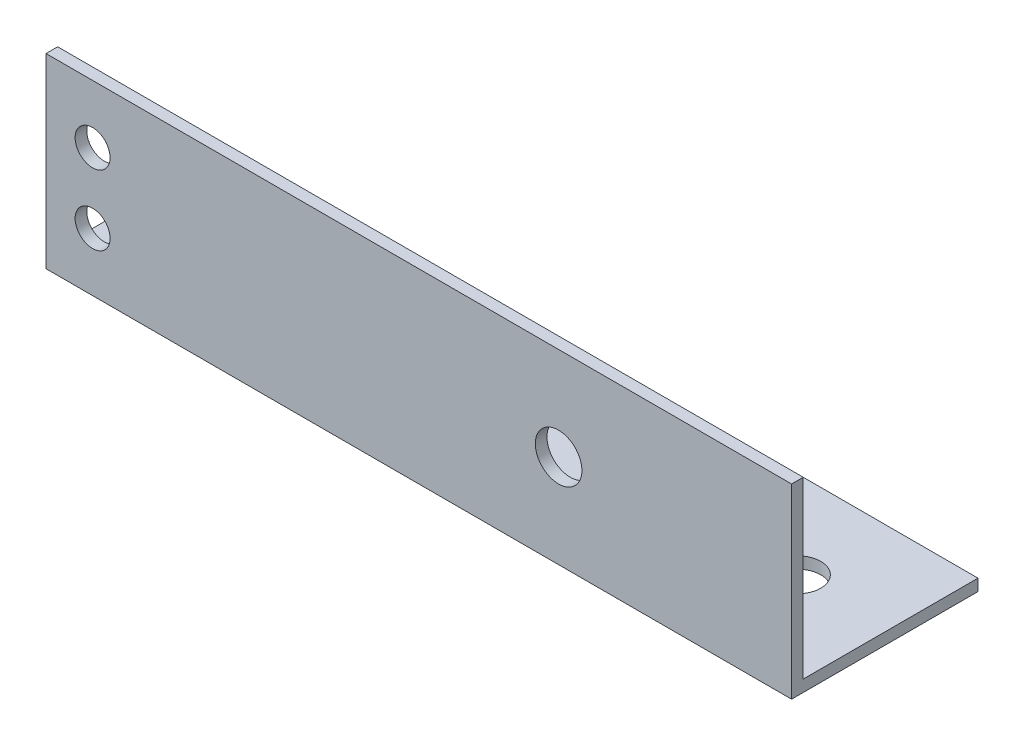
ISO-10303-21;
HEADER;
FILE_DESCRIPTION(('STEP AP214'),'2;1');
FILE_NAME('part.step','',(''),(''),'','','');
FILE_SCHEMA(('AUTOMOTIVE_DESIGN { 1 0 10303 214 1 1 1 1 }'));
ENDSEC;
DATA;
#1=APPLICATION_CONTEXT('core data for automotive mechanical design processes');
#2=APPLICATION_PROTOCOL_DEFINITION('international standard','automotive_design',2000,#1);
#3=PRODUCT_CONTEXT('',#1,'mechanical');
#4=PRODUCT('Part','Part','',(#3));
#5=PRODUCT_RELATED_PRODUCT_CATEGORY('part','',(#4));
#6=PRODUCT_DEFINITION_FORMATION('','',#4);
#7=PRODUCT_DEFINITION_CONTEXT('part definition',#1,'design');
#8=PRODUCT_DEFINITION('design','',#6,#7);
#9=PRODUCT_DEFINITION_SHAPE('','',#8);
#10=(LENGTH_UNIT() NAMED_UNIT(*) SI_UNIT(.MILLI.,.METRE.));
#11=(NAMED_UNIT(*) PLANE_ANGLE_UNIT() SI_UNIT($,.RADIAN.));
#12=(NAMED_UNIT(*) SI_UNIT($,.STERADIAN.) SOLID_ANGLE_UNIT());
#13=UNCERTAINTY_MEASURE_WITH_UNIT(LENGTH_MEASURE(1.E-05),#10,'distance_accuracy_value','');
#14=(GEOMETRIC_REPRESENTATION_CONTEXT(3) GLOBAL_UNCERTAINTY_ASSIGNED_CONTEXT((#13)) GLOBAL_UNIT_ASSIGNED_CONTEXT((#10,
#11,#12)) REPRESENTATION_CONTEXT('',''));
#15=CARTESIAN_POINT('',(0.,0.,0.));
#16=DIRECTION('',(0.,0.,1.));
#17=DIRECTION('',(1.,0.,0.));
#18=AXIS2_PLACEMENT_3D('',#15,#16,#17);
#19=CARTESIAN_POINT('',(101.6,0.,25.4));
#20=DIRECTION('',(0.,1.,0.));
#21=DIRECTION('',(0.,0.,1.));
#22=AXIS2_PLACEMENT_3D('',#19,#20,#21);
#23=PLANE('',#22);
#24=CARTESIAN_POINT('',(12.7,0.,-13.49375));
#25=DIRECTION('',(0.,1.,0.));
#26=DIRECTION('',(0.,0.,1.));
#27=AXIS2_PLACEMENT_3D('',#24,#25,#26);
#28=CIRCLE('',#27,3.175);
#29=CARTESIAN_POINT('',(12.7,0.,-10.31875));
#30=VERTEX_POINT('',#29);
#31=EDGE_CURVE('E135',#30,#30,#28,.F.);
#32=ORIENTED_EDGE('',*,*,#31,.F.);
#33=EDGE_LOOP('',(#32));
#34=FACE_BOUND('',#33,.T.);
#35=CARTESIAN_POINT('',(88.9,0.,-13.49375));
#36=DIRECTION('',(0.,1.,0.));
#37=DIRECTION('',(0.,0.,1.));
#38=AXIS2_PLACEMENT_3D('',#35,#36,#37);
#39=CIRCLE('',#38,3.175);
#40=CARTESIAN_POINT('',(88.9,0.,-10.31875));
#41=VERTEX_POINT('',#40);
#42=EDGE_CURVE('E143',#41,#41,#39,.F.);
#43=ORIENTED_EDGE('',*,*,#42,.F.);
#44=EDGE_LOOP('',(#43));
#45=FACE_BOUND('',#44,.T.);
#46=DIRECTION('',(0.,0.,-1.));
#47=VECTOR('',#46,1.);
#48=CARTESIAN_POINT('',(101.6,0.,25.4));
#49=LINE('',#48,#47);
#50=CARTESIAN_POINT('',(101.6,0.,0.));
#51=VERTEX_POINT('',#50);
#52=CARTESIAN_POINT('',(101.6,0.,-25.4));
#53=VERTEX_POINT('',#52);
#54=EDGE_CURVE('E44',#51,#53,#49,.T.);
#55=ORIENTED_EDGE('',*,*,#54,.F.);
#56=DIRECTION('',(-1.,0.,0.));
#57=VECTOR('',#56,1.);
#58=CARTESIAN_POINT('',(101.6,0.,0.));
#59=LINE('',#58,#57);
#60=CARTESIAN_POINT('',(0.,0.,0.));
#61=VERTEX_POINT('',#60);
#62=EDGE_CURVE('E96',#51,#61,#59,.T.);
#63=ORIENTED_EDGE('',*,*,#62,.T.);
#64=DIRECTION('',(0.,0.,-1.));
#65=VECTOR('',#64,1.);
#66=CARTESIAN_POINT('',(0.,0.,25.4));
#67=LINE('',#66,#65);
#68=CARTESIAN_POINT('',(0.,0.,-25.4));
#69=VERTEX_POINT('',#68);
#70=EDGE_CURVE('E110',#61,#69,#67,.T.);
#71=ORIENTED_EDGE('',*,*,#70,.T.);
#72=DIRECTION('',(-1.,0.,0.));
#73=VECTOR('',#72,1.);
#74=CARTESIAN_POINT('',(101.6,0.,-25.4));
#75=LINE('',#74,#73);
#76=EDGE_CURVE('E107',#53,#69,#75,.T.);
#77=ORIENTED_EDGE('',*,*,#76,.F.);
#78=EDGE_LOOP('',(#55,#63,#71,#77));
#79=FACE_BOUND('',#78,.T.);
#80=ADVANCED_FACE('F36',(#34,#45,#79),#23,.F.);
#81=CARTESIAN_POINT('',(101.6,25.4,0.));
#82=DIRECTION('',(0.,-1.,0.));
#83=DIRECTION('',(0.,0.,-1.));
#84=AXIS2_PLACEMENT_3D('',#81,#82,#83);
#85=PLANE('',#84);
#86=DIRECTION('',(0.,0.,1.));
#87=VECTOR('',#86,1.);
#88=CARTESIAN_POINT('',(0.,25.4,0.));
#89=LINE('',#88,#87);
#90=CARTESIAN_POINT('',(0.,25.4,-1.5875));
#91=VERTEX_POINT('',#90);
#92=CARTESIAN_POINT('',(0.,25.4,0.));
#93=VERTEX_POINT('',#92);
#94=EDGE_CURVE('E80',#91,#93,#89,.T.);
#95=ORIENTED_EDGE('',*,*,#94,.T.);
#96=DIRECTION('',(1.,0.,0.));
#97=VECTOR('',#96,1.);
#98=CARTESIAN_POINT('',(101.6,25.4,0.));
#99=LINE('',#98,#97);
#100=CARTESIAN_POINT('',(101.6,25.4,0.));
#101=VERTEX_POINT('',#100);
#102=EDGE_CURVE('E52',#93,#101,#99,.T.);
#103=ORIENTED_EDGE('',*,*,#102,.T.);
#104=DIRECTION('',(0.,0.,1.));
#105=VECTOR('',#104,1.);
#106=CARTESIAN_POINT('',(101.6,25.4,0.));
#107=LINE('',#106,#105);
#108=CARTESIAN_POINT('',(101.6,25.4,-1.5875));
#109=VERTEX_POINT('',#108);
#110=EDGE_CURVE('E11',#109,#101,#107,.T.);
#111=ORIENTED_EDGE('',*,*,#110,.F.);
#112=DIRECTION('',(-1.,0.,0.));
#113=VECTOR('',#112,1.);
#114=CARTESIAN_POINT('',(101.6,25.4,-1.5875));
#115=LINE('',#114,#113);
#116=EDGE_CURVE('E122',#109,#91,#115,.T.);
#117=ORIENTED_EDGE('',*,*,#116,.T.);
#118=EDGE_LOOP('',(#95,#103,#111,#117));
#119=FACE_BOUND('',#118,.T.);
#120=ADVANCED_FACE('F211',(#119),#85,.F.);
#121=CARTESIAN_POINT('',(101.6,0.,0.));
#122=DIRECTION('',(1.,0.,0.));
#123=DIRECTION('',(0.,0.,-1.));
#124=AXIS2_PLACEMENT_3D('',#121,#122,#123);
#125=PLANE('',#124);
#126=DIRECTION('',(0.,-1.,0.));
#127=VECTOR('',#126,1.);
#128=CARTESIAN_POINT('',(101.6,0.,0.));
#129=LINE('',#128,#127);
#130=EDGE_CURVE('E98',#101,#51,#129,.T.);
#131=ORIENTED_EDGE('',*,*,#130,.T.);
#132=ORIENTED_EDGE('',*,*,#54,.T.);
#133=DIRECTION('',(0.,-1.,0.));
#134=VECTOR('',#133,1.);
#135=CARTESIAN_POINT('',(101.6,1.5875,-25.4));
#136=LINE('',#135,#134);
#137=CARTESIAN_POINT('',(101.6,1.5875,-25.4));
#138=VERTEX_POINT('',#137);
#139=EDGE_CURVE('E129',#138,#53,#136,.T.);
#140=ORIENTED_EDGE('',*,*,#139,.F.);
#141=DIRECTION('',(0.,0.,-1.));
#142=VECTOR('',#141,1.);
#143=CARTESIAN_POINT('',(101.6,1.5875,-1.5875));
#144=LINE('',#143,#142);
#145=CARTESIAN_POINT('',(101.6,1.5875,-1.5875));
#146=VERTEX_POINT('',#145);
#147=EDGE_CURVE('E138',#146,#138,#144,.T.);
#148=ORIENTED_EDGE('',*,*,#147,.F.);
#149=DIRECTION('',(0.,-1.,0.));
#150=VECTOR('',#149,1.);
#151=CARTESIAN_POINT('',(101.6,25.4,-1.5875));
#152=LINE('',#151,#150);
#153=EDGE_CURVE('E126',#109,#146,#152,.T.);
#154=ORIENTED_EDGE('',*,*,#153,.F.);
#155=ORIENTED_EDGE('',*,*,#110,.T.);
#156=EDGE_LOOP('',(#131,#132,#140,#148,#154,#155));
#157=FACE_BOUND('',#156,.T.);
#158=ADVANCED_FACE('F103',(#157),#125,.T.);
#159=CARTESIAN_POINT('',(0.,0.,0.));
#160=DIRECTION('',(1.,0.,0.));
#161=DIRECTION('',(0.,0.,-1.));
#162=AXIS2_PLACEMENT_3D('',#159,#160,#161);
#163=PLANE('',#162);
#164=ORIENTED_EDGE('',*,*,#70,.F.);
#165=DIRECTION('',(0.,-1.,0.));
#166=VECTOR('',#165,1.);
#167=CARTESIAN_POINT('',(0.,0.,0.));
#168=LINE('',#167,#166);
#169=EDGE_CURVE('E99',#93,#61,#168,.T.);
#170=ORIENTED_EDGE('',*,*,#169,.F.);
#171=ORIENTED_EDGE('',*,*,#94,.F.);
#172=DIRECTION('',(0.,-1.,0.));
#173=VECTOR('',#172,1.);
#174=CARTESIAN_POINT('',(0.,25.4,-1.5875));
#175=LINE('',#174,#173);
#176=CARTESIAN_POINT('',(0.,1.5875,-1.5875));
#177=VERTEX_POINT('',#176);
#178=EDGE_CURVE('E127',#91,#177,#175,.T.);
#179=ORIENTED_EDGE('',*,*,#178,.T.);
#180=DIRECTION('',(0.,0.,-1.));
#181=VECTOR('',#180,1.);
#182=CARTESIAN_POINT('',(0.,1.5875,-1.5875));
#183=LINE('',#182,#181);
#184=CARTESIAN_POINT('',(0.,1.5875,-25.4));
#185=VERTEX_POINT('',#184);
#186=EDGE_CURVE('E130',#177,#185,#183,.T.);
#187=ORIENTED_EDGE('',*,*,#186,.T.);
#188=DIRECTION('',(0.,-1.,0.));
#189=VECTOR('',#188,1.);
#190=CARTESIAN_POINT('',(0.,1.5875,-25.4));
#191=LINE('',#190,#189);
#192=EDGE_CURVE('E133',#185,#69,#191,.T.);
#193=ORIENTED_EDGE('',*,*,#192,.T.);
#194=EDGE_LOOP('',(#164,#170,#171,#179,#187,#193));
#195=FACE_BOUND('',#194,.T.);
#196=ADVANCED_FACE('F187',(#195),#163,.F.);
#197=CARTESIAN_POINT('',(6.35,7.9375,-100.0125));
#198=DIRECTION('',(0.,0.,1.));
#199=DIRECTION('',(1.,0.,0.));
#200=AXIS2_PLACEMENT_3D('',#197,#198,#199);
#201=CYLINDRICAL_SURFACE('',#200,2.38125);
#202=CARTESIAN_POINT('',(6.35,7.9375,0.));
#203=DIRECTION('',(0.,0.,-1.));
#204=DIRECTION('',(-1.,0.,0.));
#205=AXIS2_PLACEMENT_3D('',#202,#203,#204);
#206=CIRCLE('',#205,2.38125);
#207=CARTESIAN_POINT('',(3.96875,7.9375,0.));
#208=VERTEX_POINT('',#207);
#209=EDGE_CURVE('E162',#208,#208,#206,.F.);
#210=ORIENTED_EDGE('',*,*,#209,.T.);
#211=EDGE_LOOP('',(#210));
#212=FACE_BOUND('',#211,.T.);
#213=CARTESIAN_POINT('',(6.35,7.9375,-1.5875));
#214=DIRECTION('',(0.,0.,1.));
#215=DIRECTION('',(1.,0.,0.));
#216=AXIS2_PLACEMENT_3D('',#213,#214,#215);
#217=CIRCLE('',#216,2.38125);
#218=CARTESIAN_POINT('',(8.73125,7.9375,-1.5875));
#219=VERTEX_POINT('',#218);
#220=EDGE_CURVE('E153',#219,#219,#217,.T.);
#221=ORIENTED_EDGE('',*,*,#220,.F.);
#222=EDGE_LOOP('',(#221));
#223=FACE_BOUND('',#222,.T.);
#224=ADVANCED_FACE('F183',(#212,#223),#201,.F.);
#225=CARTESIAN_POINT('',(6.35,17.4625,-100.0125));
#226=DIRECTION('',(0.,0.,1.));
#227=DIRECTION('',(1.,0.,0.));
#228=AXIS2_PLACEMENT_3D('',#225,#226,#227);
#229=CYLINDRICAL_SURFACE('',#228,2.38125);
#230=CARTESIAN_POINT('',(6.35,17.4625,0.));
#231=DIRECTION('',(0.,0.,-1.));
#232=DIRECTION('',(-1.,0.,0.));
#233=AXIS2_PLACEMENT_3D('',#230,#231,#232);
#234=CIRCLE('',#233,2.38125);
#235=CARTESIAN_POINT('',(3.96875,17.4625,0.));
#236=VERTEX_POINT('',#235);
#237=EDGE_CURVE('E165',#236,#236,#234,.F.);
#238=ORIENTED_EDGE('',*,*,#237,.T.);
#239=EDGE_LOOP('',(#238));
#240=FACE_BOUND('',#239,.T.);
#241=CARTESIAN_POINT('',(6.35,17.4625,-1.5875));
#242=DIRECTION('',(0.,0.,1.));
#243=DIRECTION('',(1.,0.,0.));
#244=AXIS2_PLACEMENT_3D('',#241,#242,#243);
#245=CIRCLE('',#244,2.38125);
#246=CARTESIAN_POINT('',(8.73125,17.4625,-1.5875));
#247=VERTEX_POINT('',#246);
#248=EDGE_CURVE('E156',#247,#247,#245,.T.);
#249=ORIENTED_EDGE('',*,*,#248,.F.);
#250=EDGE_LOOP('',(#249));
#251=FACE_BOUND('',#250,.T.);
#252=ADVANCED_FACE('F186',(#240,#251),#229,.F.);
#253=CARTESIAN_POINT('',(69.85,12.7,-100.0125));
#254=DIRECTION('',(0.,0.,1.));
#255=DIRECTION('',(1.,0.,0.));
#256=AXIS2_PLACEMENT_3D('',#253,#254,#255);
#257=CYLINDRICAL_SURFACE('',#256,3.175);
#258=CARTESIAN_POINT('',(69.85,12.7,0.));
#259=DIRECTION('',(0.,0.,-1.));
#260=DIRECTION('',(-1.,0.,0.));
#261=AXIS2_PLACEMENT_3D('',#258,#259,#260);
#262=CIRCLE('',#261,3.175);
#263=CARTESIAN_POINT('',(66.675,12.7,0.));
#264=VERTEX_POINT('',#263);
#265=EDGE_CURVE('E39',#264,#264,#262,.F.);
#266=ORIENTED_EDGE('',*,*,#265,.T.);
#267=EDGE_LOOP('',(#266));
#268=FACE_BOUND('',#267,.T.);
#269=CARTESIAN_POINT('',(69.85,12.7,-1.5875));
#270=DIRECTION('',(0.,0.,1.));
#271=DIRECTION('',(1.,0.,0.));
#272=AXIS2_PLACEMENT_3D('',#269,#270,#271);
#273=CIRCLE('',#272,3.175);
#274=CARTESIAN_POINT('',(73.025,12.7,-1.5875));
#275=VERTEX_POINT('',#274);
#276=EDGE_CURVE('E150',#275,#275,#273,.T.);
#277=ORIENTED_EDGE('',*,*,#276,.F.);
#278=EDGE_LOOP('',(#277));
#279=FACE_BOUND('',#278,.T.);
#280=ADVANCED_FACE('F173',(#268,#279),#257,.F.);
#281=CARTESIAN_POINT('',(101.6,1.5875,-25.4));
#282=DIRECTION('',(0.,0.,-1.));
#283=DIRECTION('',(-1.,0.,0.));
#284=AXIS2_PLACEMENT_3D('',#281,#282,#283);
#285=PLANE('',#284);
#286=ORIENTED_EDGE('',*,*,#192,.F.);
#287=DIRECTION('',(-1.,0.,0.));
#288=VECTOR('',#287,1.);
#289=CARTESIAN_POINT('',(101.6,1.5875,-25.4));
#290=LINE('',#289,#288);
#291=EDGE_CURVE('E114',#138,#185,#290,.T.);
#292=ORIENTED_EDGE('',*,*,#291,.F.);
#293=ORIENTED_EDGE('',*,*,#139,.T.);
#294=ORIENTED_EDGE('',*,*,#76,.T.);
#295=EDGE_LOOP('',(#286,#292,#293,#294));
#296=FACE_BOUND('',#295,.T.);
#297=ADVANCED_FACE('F200',(#296),#285,.T.);
#298=CARTESIAN_POINT('',(101.6,1.5875,-1.5875));
#299=DIRECTION('',(0.,1.,0.));
#300=DIRECTION('',(0.,0.,1.));
#301=AXIS2_PLACEMENT_3D('',#298,#299,#300);
#302=PLANE('',#301);
#303=CARTESIAN_POINT('',(12.7,1.5875,-13.49375));
#304=DIRECTION('',(0.,-1.,0.));
#305=DIRECTION('',(0.,0.,-1.));
#306=AXIS2_PLACEMENT_3D('',#303,#304,#305);
#307=CIRCLE('',#306,3.175);
#308=CARTESIAN_POINT('',(12.7,1.5875,-16.66875));
#309=VERTEX_POINT('',#308);
#310=EDGE_CURVE('E146',#309,#309,#307,.T.);
#311=ORIENTED_EDGE('',*,*,#310,.T.);
#312=EDGE_LOOP('',(#311));
#313=FACE_BOUND('',#312,.T.);
#314=CARTESIAN_POINT('',(88.9,1.5875,-13.49375));
#315=DIRECTION('',(0.,-1.,0.));
#316=DIRECTION('',(0.,0.,-1.));
#317=AXIS2_PLACEMENT_3D('',#314,#315,#316);
#318=CIRCLE('',#317,3.175);
#319=CARTESIAN_POINT('',(88.9,1.5875,-16.66875));
#320=VERTEX_POINT('',#319);
#321=EDGE_CURVE('E147',#320,#320,#318,.T.);
#322=ORIENTED_EDGE('',*,*,#321,.T.);
#323=EDGE_LOOP('',(#322));
#324=FACE_BOUND('',#323,.T.);
#325=ORIENTED_EDGE('',*,*,#186,.F.);
#326=DIRECTION('',(-1.,0.,0.));
#327=VECTOR('',#326,1.);
#328=CARTESIAN_POINT('',(101.6,1.5875,-1.5875));
#329=LINE('',#328,#327);
#330=EDGE_CURVE('E118',#146,#177,#329,.T.);
#331=ORIENTED_EDGE('',*,*,#330,.F.);
#332=ORIENTED_EDGE('',*,*,#147,.T.);
#333=ORIENTED_EDGE('',*,*,#291,.T.);
#334=EDGE_LOOP('',(#325,#331,#332,#333));
#335=FACE_BOUND('',#334,.T.);
#336=ADVANCED_FACE('F195',(#313,#324,#335),#302,.T.);
#337=CARTESIAN_POINT('',(101.6,25.4,-1.5875));
#338=DIRECTION('',(0.,0.,-1.));
#339=DIRECTION('',(0.,1.,0.));
#340=AXIS2_PLACEMENT_3D('',#337,#338,#339);
#341=PLANE('',#340);
#342=ORIENTED_EDGE('',*,*,#276,.T.);
#343=EDGE_LOOP('',(#342));
#344=FACE_BOUND('',#343,.T.);
#345=ORIENTED_EDGE('',*,*,#248,.T.);
#346=EDGE_LOOP('',(#345));
#347=FACE_BOUND('',#346,.T.);
#348=ORIENTED_EDGE('',*,*,#220,.T.);
#349=EDGE_LOOP('',(#348));
#350=FACE_BOUND('',#349,.T.);
#351=ORIENTED_EDGE('',*,*,#178,.F.);
#352=ORIENTED_EDGE('',*,*,#116,.F.);
#353=ORIENTED_EDGE('',*,*,#153,.T.);
#354=ORIENTED_EDGE('',*,*,#330,.T.);
#355=EDGE_LOOP('',(#351,#352,#353,#354));
#356=FACE_BOUND('',#355,.T.);
#357=ADVANCED_FACE('F191',(#344,#347,#350,#356),#341,.T.);
#358=CARTESIAN_POINT('',(88.9,-100.0125,-13.49375));
#359=DIRECTION('',(0.,1.,0.));
#360=DIRECTION('',(0.,0.,1.));
#361=AXIS2_PLACEMENT_3D('',#358,#359,#360);
#362=CYLINDRICAL_SURFACE('',#361,3.175);
#363=ORIENTED_EDGE('',*,*,#321,.F.);
#364=EDGE_LOOP('',(#363));
#365=FACE_BOUND('',#364,.T.);
#366=ORIENTED_EDGE('',*,*,#42,.T.);
#367=EDGE_LOOP('',(#366));
#368=FACE_BOUND('',#367,.T.);
#369=ADVANCED_FACE('F194',(#365,#368),#362,.F.);
#370=CARTESIAN_POINT('',(12.7,-100.0125,-13.49375));
#371=DIRECTION('',(0.,1.,0.));
#372=DIRECTION('',(0.,0.,1.));
#373=AXIS2_PLACEMENT_3D('',#370,#371,#372);
#374=CYLINDRICAL_SURFACE('',#373,3.175);
#375=ORIENTED_EDGE('',*,*,#310,.F.);
#376=EDGE_LOOP('',(#375));
#377=FACE_BOUND('',#376,.T.);
#378=ORIENTED_EDGE('',*,*,#31,.T.);
#379=EDGE_LOOP('',(#378));
#380=FACE_BOUND('',#379,.T.);
#381=ADVANCED_FACE('F178',(#377,#380),#374,.F.);
#382=CARTESIAN_POINT('',(101.6,0.,0.));
#383=DIRECTION('',(0.,0.,-1.));
#384=DIRECTION('',(-1.,0.,0.));
#385=AXIS2_PLACEMENT_3D('',#382,#383,#384);
#386=PLANE('',#385);
#387=ORIENTED_EDGE('',*,*,#237,.F.);
#388=EDGE_LOOP('',(#387));
#389=FACE_BOUND('',#388,.T.);
#390=ORIENTED_EDGE('',*,*,#265,.F.);
#391=EDGE_LOOP('',(#390));
#392=FACE_BOUND('',#391,.T.);
#393=ORIENTED_EDGE('',*,*,#209,.F.);
#394=EDGE_LOOP('',(#393));
#395=FACE_BOUND('',#394,.T.);
#396=ORIENTED_EDGE('',*,*,#169,.T.);
#397=ORIENTED_EDGE('',*,*,#62,.F.);
#398=ORIENTED_EDGE('',*,*,#130,.F.);
#399=ORIENTED_EDGE('',*,*,#102,.F.);
#400=EDGE_LOOP('',(#396,#397,#398,#399));
#401=FACE_BOUND('',#400,.T.);
#402=ADVANCED_FACE('F97',(#389,#392,#395,#401),#386,.F.);
#403=CLOSED_SHELL('',(#80,#120,#158,#196,#224,#252,#280,#297,#336,#357,#369,#381,#402));
#404=MANIFOLD_SOLID_BREP('B2',#403);
#405=ADVANCED_BREP_SHAPE_REPRESENTATION('',(#18,#404),#14);
#406=SHAPE_DEFINITION_REPRESENTATION(#9,#405);
ENDSEC;
END-ISO-10303-21;
